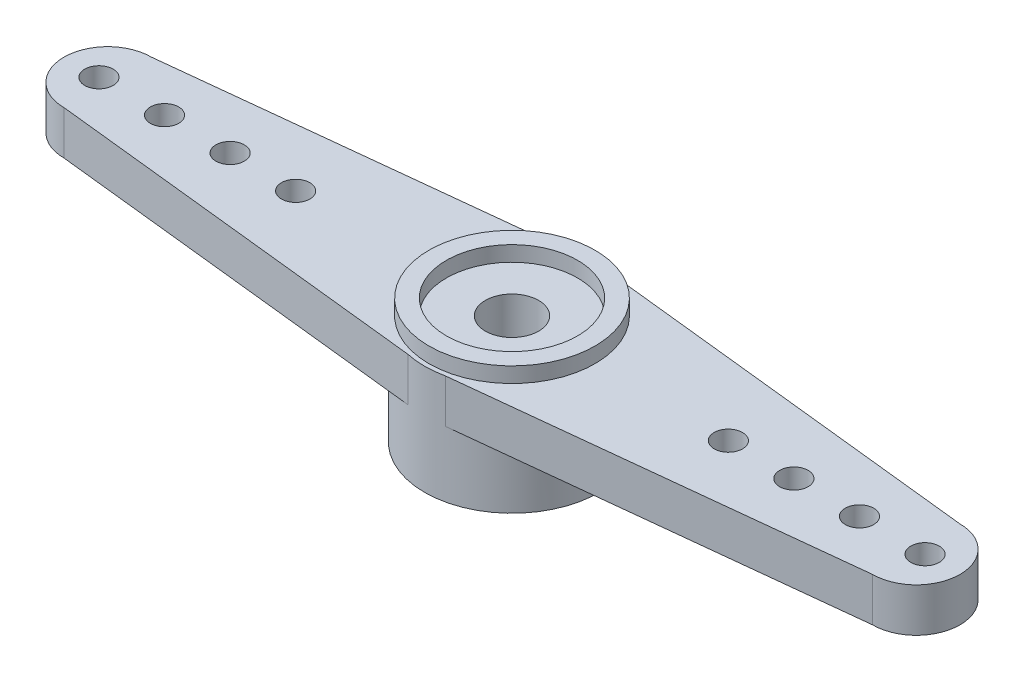
ISO-10303-21;
HEADER;
FILE_DESCRIPTION(('STEP AP214'),'2;1');
FILE_NAME('part.step','',(''),(''),'','','');
FILE_SCHEMA(('AUTOMOTIVE_DESIGN { 1 0 10303 214 1 1 1 1 }'));
ENDSEC;
DATA;
#1=APPLICATION_CONTEXT('core data for automotive mechanical design processes');
#2=APPLICATION_PROTOCOL_DEFINITION('international standard','automotive_design',2000,#1);
#3=PRODUCT_CONTEXT('',#1,'mechanical');
#4=PRODUCT('Part','Part','',(#3));
#5=PRODUCT_RELATED_PRODUCT_CATEGORY('part','',(#4));
#6=PRODUCT_DEFINITION_FORMATION('','',#4);
#7=PRODUCT_DEFINITION_CONTEXT('part definition',#1,'design');
#8=PRODUCT_DEFINITION('design','',#6,#7);
#9=PRODUCT_DEFINITION_SHAPE('','',#8);
#10=(LENGTH_UNIT() NAMED_UNIT(*) SI_UNIT(.MILLI.,.METRE.));
#11=(NAMED_UNIT(*) PLANE_ANGLE_UNIT() SI_UNIT($,.RADIAN.));
#12=(NAMED_UNIT(*) SI_UNIT($,.STERADIAN.) SOLID_ANGLE_UNIT());
#13=UNCERTAINTY_MEASURE_WITH_UNIT(LENGTH_MEASURE(1.E-05),#10,'distance_accuracy_value','');
#14=(GEOMETRIC_REPRESENTATION_CONTEXT(3) GLOBAL_UNCERTAINTY_ASSIGNED_CONTEXT((#13)) GLOBAL_UNIT_ASSIGNED_CONTEXT((#10,
#11,#12)) REPRESENTATION_CONTEXT('',''));
#15=CARTESIAN_POINT('',(0.,0.,0.));
#16=DIRECTION('',(0.,0.,1.));
#17=DIRECTION('',(1.,0.,0.));
#18=AXIS2_PLACEMENT_3D('',#15,#16,#17);
#19=CARTESIAN_POINT('',(0.,5.,0.));
#20=DIRECTION('',(0.,1.,0.));
#21=DIRECTION('',(0.,0.,1.));
#22=AXIS2_PLACEMENT_3D('',#19,#20,#21);
#23=PLANE('',#22);
#24=CARTESIAN_POINT('',(15.9,5.,0.));
#25=DIRECTION('',(0.,-1.,0.));
#26=DIRECTION('',(0.,0.,1.));
#27=AXIS2_PLACEMENT_3D('',#24,#25,#26);
#28=CIRCLE('',#27,0.649999999999999);
#29=CARTESIAN_POINT('',(15.9,5.,0.649999999999999));
#30=VERTEX_POINT('',#29);
#31=EDGE_CURVE('E247',#30,#30,#28,.T.);
#32=ORIENTED_EDGE('',*,*,#31,.T.);
#33=EDGE_LOOP('',(#32));
#34=FACE_BOUND('',#33,.T.);
#35=CARTESIAN_POINT('',(9.90000000000001,5.,0.));
#36=DIRECTION('',(0.,-1.,0.));
#37=DIRECTION('',(0.,0.,1.));
#38=AXIS2_PLACEMENT_3D('',#35,#36,#37);
#39=CIRCLE('',#38,0.649999999999999);
#40=CARTESIAN_POINT('',(9.90000000000001,5.,0.649999999999999));
#41=VERTEX_POINT('',#40);
#42=EDGE_CURVE('E263',#41,#41,#39,.T.);
#43=ORIENTED_EDGE('',*,*,#42,.T.);
#44=EDGE_LOOP('',(#43));
#45=FACE_BOUND('',#44,.T.);
#46=DIRECTION('',(0.994207047565849,0.,0.107481842980092));
#47=VECTOR('',#46,1.);
#48=CARTESIAN_POINT('',(-0.854873646209387,5.,3.90758122743682));
#49=LINE('',#48,#47);
#50=CARTESIAN_POINT('',(-18.5,5.,2.));
#51=VERTEX_POINT('',#50);
#52=CARTESIAN_POINT('',(-0.854873646209387,5.,3.90758122743682));
#53=VERTEX_POINT('',#52);
#54=EDGE_CURVE('E179',#51,#53,#49,.T.);
#55=ORIENTED_EDGE('',*,*,#54,.T.);
#56=CARTESIAN_POINT('',(0.,5.,0.));
#57=DIRECTION('',(0.,1.,0.));
#58=DIRECTION('',(0.,0.,1.));
#59=AXIS2_PLACEMENT_3D('',#56,#57,#58);
#60=CIRCLE('',#59,4.);
#61=CARTESIAN_POINT('',(0.854873646209387,5.,3.90758122743682));
#62=VERTEX_POINT('',#61);
#63=EDGE_CURVE('E117',#53,#62,#60,.T.);
#64=ORIENTED_EDGE('',*,*,#63,.T.);
#65=DIRECTION('',(-0.994207047565849,0.,0.107481842980092));
#66=VECTOR('',#65,1.);
#67=CARTESIAN_POINT('',(0.854873646209387,5.,3.90758122743682));
#68=LINE('',#67,#66);
#69=CARTESIAN_POINT('',(18.5,5.,2.));
#70=VERTEX_POINT('',#69);
#71=EDGE_CURVE('E99',#70,#62,#68,.T.);
#72=ORIENTED_EDGE('',*,*,#71,.F.);
#73=CARTESIAN_POINT('',(18.5,5.,0.));
#74=DIRECTION('',(0.,-1.,0.));
#75=DIRECTION('',(0.,0.,1.));
#76=AXIS2_PLACEMENT_3D('',#73,#74,#75);
#77=CIRCLE('',#76,2.);
#78=CARTESIAN_POINT('',(18.5,5.,-2.));
#79=VERTEX_POINT('',#78);
#80=EDGE_CURVE('E114',#79,#70,#77,.T.);
#81=ORIENTED_EDGE('',*,*,#80,.F.);
#82=DIRECTION('',(0.994207047565849,0.,0.107481842980092));
#83=VECTOR('',#82,1.);
#84=CARTESIAN_POINT('',(0.854873646209388,5.,-3.90758122743682));
#85=LINE('',#84,#83);
#86=CARTESIAN_POINT('',(0.854873646209388,5.,-3.90758122743682));
#87=VERTEX_POINT('',#86);
#88=EDGE_CURVE('E121',#87,#79,#85,.T.);
#89=ORIENTED_EDGE('',*,*,#88,.F.);
#90=CARTESIAN_POINT('',(-0.854873646209388,5.,-3.90758122743682));
#91=VERTEX_POINT('',#90);
#92=EDGE_CURVE('E53',#87,#91,#60,.T.);
#93=ORIENTED_EDGE('',*,*,#92,.T.);
#94=DIRECTION('',(-0.994207047565849,0.,0.107481842980092));
#95=VECTOR('',#94,1.);
#96=CARTESIAN_POINT('',(-0.854873646209388,5.,-3.90758122743682));
#97=LINE('',#96,#95);
#98=CARTESIAN_POINT('',(-18.5,5.,-2.));
#99=VERTEX_POINT('',#98);
#100=EDGE_CURVE('E175',#91,#99,#97,.T.);
#101=ORIENTED_EDGE('',*,*,#100,.T.);
#102=CARTESIAN_POINT('',(-18.5,5.,0.));
#103=DIRECTION('',(0.,1.,0.));
#104=DIRECTION('',(0.,0.,1.));
#105=AXIS2_PLACEMENT_3D('',#102,#103,#104);
#106=CIRCLE('',#105,2.);
#107=EDGE_CURVE('E177',#99,#51,#106,.T.);
#108=ORIENTED_EDGE('',*,*,#107,.T.);
#109=EDGE_LOOP('',(#55,#64,#72,#81,#89,#93,#101,#108));
#110=FACE_BOUND('',#109,.T.);
#111=CARTESIAN_POINT('',(-9.90000000000001,5.,0.));
#112=DIRECTION('',(0.,1.,0.));
#113=DIRECTION('',(0.,0.,1.));
#114=AXIS2_PLACEMENT_3D('',#111,#112,#113);
#115=CIRCLE('',#114,0.649999999999999);
#116=CARTESIAN_POINT('',(-9.90000000000001,5.,0.649999999999999));
#117=VERTEX_POINT('',#116);
#118=EDGE_CURVE('E165',#117,#117,#115,.T.);
#119=ORIENTED_EDGE('',*,*,#118,.F.);
#120=EDGE_LOOP('',(#119));
#121=FACE_BOUND('',#120,.T.);
#122=CARTESIAN_POINT('',(-12.9,5.,0.));
#123=DIRECTION('',(0.,1.,0.));
#124=DIRECTION('',(0.,0.,1.));
#125=AXIS2_PLACEMENT_3D('',#122,#123,#124);
#126=CIRCLE('',#125,0.649999999999999);
#127=CARTESIAN_POINT('',(-12.9,5.,0.649999999999999));
#128=VERTEX_POINT('',#127);
#129=EDGE_CURVE('E159',#128,#128,#126,.T.);
#130=ORIENTED_EDGE('',*,*,#129,.F.);
#131=EDGE_LOOP('',(#130));
#132=FACE_BOUND('',#131,.T.);
#133=CARTESIAN_POINT('',(-15.9,5.,0.));
#134=DIRECTION('',(0.,1.,0.));
#135=DIRECTION('',(0.,0.,1.));
#136=AXIS2_PLACEMENT_3D('',#133,#134,#135);
#137=CIRCLE('',#136,0.649999999999999);
#138=CARTESIAN_POINT('',(-15.9,5.,0.649999999999999));
#139=VERTEX_POINT('',#138);
#140=EDGE_CURVE('E153',#139,#139,#137,.T.);
#141=ORIENTED_EDGE('',*,*,#140,.F.);
#142=EDGE_LOOP('',(#141));
#143=FACE_BOUND('',#142,.T.);
#144=CARTESIAN_POINT('',(-18.9,5.,0.));
#145=DIRECTION('',(0.,1.,0.));
#146=DIRECTION('',(0.,0.,1.));
#147=AXIS2_PLACEMENT_3D('',#144,#145,#146);
#148=CIRCLE('',#147,0.650000000000001);
#149=CARTESIAN_POINT('',(-18.9,5.,0.650000000000001));
#150=VERTEX_POINT('',#149);
#151=EDGE_CURVE('E147',#150,#150,#148,.T.);
#152=ORIENTED_EDGE('',*,*,#151,.F.);
#153=EDGE_LOOP('',(#152));
#154=FACE_BOUND('',#153,.T.);
#155=CARTESIAN_POINT('',(0.,5.,0.));
#156=DIRECTION('',(0.,1.,0.));
#157=DIRECTION('',(0.,0.,1.));
#158=AXIS2_PLACEMENT_3D('',#155,#156,#157);
#159=CIRCLE('',#158,3.8);
#160=CARTESIAN_POINT('',(0.,5.,3.8));
#161=VERTEX_POINT('',#160);
#162=EDGE_CURVE('E143',#161,#161,#159,.T.);
#163=ORIENTED_EDGE('',*,*,#162,.F.);
#164=EDGE_LOOP('',(#163));
#165=FACE_BOUND('',#164,.T.);
#166=CARTESIAN_POINT('',(12.9,5.,0.));
#167=DIRECTION('',(0.,-1.,0.));
#168=DIRECTION('',(0.,0.,1.));
#169=AXIS2_PLACEMENT_3D('',#166,#167,#168);
#170=CIRCLE('',#169,0.649999999999999);
#171=CARTESIAN_POINT('',(12.9,5.,0.649999999999999));
#172=VERTEX_POINT('',#171);
#173=EDGE_CURVE('E260',#172,#172,#170,.T.);
#174=ORIENTED_EDGE('',*,*,#173,.T.);
#175=EDGE_LOOP('',(#174));
#176=FACE_BOUND('',#175,.T.);
#177=CARTESIAN_POINT('',(18.9,5.,0.));
#178=DIRECTION('',(0.,-1.,0.));
#179=DIRECTION('',(0.,0.,1.));
#180=AXIS2_PLACEMENT_3D('',#177,#178,#179);
#181=CIRCLE('',#180,0.650000000000001);
#182=CARTESIAN_POINT('',(18.9,5.,0.650000000000001));
#183=VERTEX_POINT('',#182);
#184=EDGE_CURVE('E248',#183,#183,#181,.T.);
#185=ORIENTED_EDGE('',*,*,#184,.T.);
#186=EDGE_LOOP('',(#185));
#187=FACE_BOUND('',#186,.T.);
#188=ADVANCED_FACE('F31',(#34,#45,#110,#121,#132,#143,#154,#165,#176,#187),#23,.T.);
#189=CARTESIAN_POINT('',(0.,3.,0.));
#190=DIRECTION('',(0.,1.,0.));
#191=DIRECTION('',(0.,0.,1.));
#192=AXIS2_PLACEMENT_3D('',#189,#190,#191);
#193=PLANE('',#192);
#194=CARTESIAN_POINT('',(15.9,3.,0.));
#195=DIRECTION('',(0.,-1.,0.));
#196=DIRECTION('',(0.,0.,1.));
#197=AXIS2_PLACEMENT_3D('',#194,#195,#196);
#198=CIRCLE('',#197,0.649999999999999);
#199=CARTESIAN_POINT('',(15.9,3.,0.649999999999999));
#200=VERTEX_POINT('',#199);
#201=EDGE_CURVE('E251',#200,#200,#198,.T.);
#202=ORIENTED_EDGE('',*,*,#201,.F.);
#203=EDGE_LOOP('',(#202));
#204=FACE_BOUND('',#203,.T.);
#205=CARTESIAN_POINT('',(9.90000000000001,3.,0.));
#206=DIRECTION('',(0.,-1.,0.));
#207=DIRECTION('',(0.,0.,1.));
#208=AXIS2_PLACEMENT_3D('',#205,#206,#207);
#209=CIRCLE('',#208,0.649999999999999);
#210=CARTESIAN_POINT('',(9.90000000000001,3.,0.649999999999999));
#211=VERTEX_POINT('',#210);
#212=EDGE_CURVE('E129',#211,#211,#209,.T.);
#213=ORIENTED_EDGE('',*,*,#212,.F.);
#214=EDGE_LOOP('',(#213));
#215=FACE_BOUND('',#214,.T.);
#216=DIRECTION('',(-0.994207047565849,0.,0.107481842980092));
#217=VECTOR('',#216,1.);
#218=CARTESIAN_POINT('',(0.854873646209387,3.,3.90758122743682));
#219=LINE('',#218,#217);
#220=CARTESIAN_POINT('',(18.5,3.,2.));
#221=VERTEX_POINT('',#220);
#222=CARTESIAN_POINT('',(0.854873646209387,3.,3.90758122743682));
#223=VERTEX_POINT('',#222);
#224=EDGE_CURVE('E101',#221,#223,#219,.T.);
#225=ORIENTED_EDGE('',*,*,#224,.T.);
#226=CARTESIAN_POINT('',(0.,3.,0.));
#227=DIRECTION('',(0.,1.,0.));
#228=DIRECTION('',(0.,0.,1.));
#229=AXIS2_PLACEMENT_3D('',#226,#227,#228);
#230=CIRCLE('',#229,4.);
#231=CARTESIAN_POINT('',(0.854873646209388,3.,-3.90758122743682));
#232=VERTEX_POINT('',#231);
#233=EDGE_CURVE('E47',#223,#232,#230,.T.);
#234=ORIENTED_EDGE('',*,*,#233,.T.);
#235=DIRECTION('',(0.994207047565849,0.,0.107481842980092));
#236=VECTOR('',#235,1.);
#237=CARTESIAN_POINT('',(0.854873646209388,3.,-3.90758122743682));
#238=LINE('',#237,#236);
#239=CARTESIAN_POINT('',(18.5,3.,-2.));
#240=VERTEX_POINT('',#239);
#241=EDGE_CURVE('E118',#232,#240,#238,.T.);
#242=ORIENTED_EDGE('',*,*,#241,.T.);
#243=CARTESIAN_POINT('',(18.5,3.,0.));
#244=DIRECTION('',(0.,-1.,0.));
#245=DIRECTION('',(0.,0.,1.));
#246=AXIS2_PLACEMENT_3D('',#243,#244,#245);
#247=CIRCLE('',#246,2.);
#248=EDGE_CURVE('E128',#240,#221,#247,.T.);
#249=ORIENTED_EDGE('',*,*,#248,.T.);
#250=EDGE_LOOP('',(#225,#234,#242,#249));
#251=FACE_BOUND('',#250,.T.);
#252=CARTESIAN_POINT('',(12.9,3.,0.));
#253=DIRECTION('',(0.,-1.,0.));
#254=DIRECTION('',(0.,0.,1.));
#255=AXIS2_PLACEMENT_3D('',#252,#253,#254);
#256=CIRCLE('',#255,0.649999999999999);
#257=CARTESIAN_POINT('',(12.9,3.,0.649999999999999));
#258=VERTEX_POINT('',#257);
#259=EDGE_CURVE('E242',#258,#258,#256,.T.);
#260=ORIENTED_EDGE('',*,*,#259,.F.);
#261=EDGE_LOOP('',(#260));
#262=FACE_BOUND('',#261,.T.);
#263=CARTESIAN_POINT('',(18.9,3.,0.));
#264=DIRECTION('',(0.,-1.,0.));
#265=DIRECTION('',(0.,0.,1.));
#266=AXIS2_PLACEMENT_3D('',#263,#264,#265);
#267=CIRCLE('',#266,0.650000000000001);
#268=CARTESIAN_POINT('',(18.9,3.,0.650000000000001));
#269=VERTEX_POINT('',#268);
#270=EDGE_CURVE('E245',#269,#269,#267,.T.);
#271=ORIENTED_EDGE('',*,*,#270,.F.);
#272=EDGE_LOOP('',(#271));
#273=FACE_BOUND('',#272,.T.);
#274=ADVANCED_FACE('F232',(#204,#215,#251,#262,#273),#193,.F.);
#275=CARTESIAN_POINT('',(0.,3.7,0.));
#276=DIRECTION('',(0.,-1.,0.));
#277=DIRECTION('',(0.,0.,-1.));
#278=AXIS2_PLACEMENT_3D('',#275,#276,#277);
#279=CYLINDRICAL_SURFACE('',#278,3.);
#280=CARTESIAN_POINT('',(0.,0.,0.));
#281=DIRECTION('',(0.,-1.,0.));
#282=DIRECTION('',(0.,0.,-1.));
#283=AXIS2_PLACEMENT_3D('',#280,#281,#282);
#284=CIRCLE('',#283,3.);
#285=CARTESIAN_POINT('',(0.,0.,-3.));
#286=VERTEX_POINT('',#285);
#287=EDGE_CURVE('E137',#286,#286,#284,.T.);
#288=ORIENTED_EDGE('',*,*,#287,.T.);
#289=EDGE_LOOP('',(#288));
#290=FACE_BOUND('',#289,.T.);
#291=CARTESIAN_POINT('',(0.,3.,0.));
#292=DIRECTION('',(0.,1.,0.));
#293=DIRECTION('',(0.,0.,1.));
#294=AXIS2_PLACEMENT_3D('',#291,#292,#293);
#295=CIRCLE('',#294,3.);
#296=CARTESIAN_POINT('',(0.,3.,3.));
#297=VERTEX_POINT('',#296);
#298=EDGE_CURVE('E11',#297,#297,#295,.F.);
#299=ORIENTED_EDGE('',*,*,#298,.F.);
#300=EDGE_LOOP('',(#299));
#301=FACE_BOUND('',#300,.T.);
#302=ADVANCED_FACE('F235',(#290,#301),#279,.F.);
#303=CARTESIAN_POINT('',(0.,3.,0.));
#304=DIRECTION('',(0.,-1.,0.));
#305=DIRECTION('',(0.,0.,-1.));
#306=AXIS2_PLACEMENT_3D('',#303,#304,#305);
#307=CYLINDRICAL_SURFACE('',#306,4.);
#308=DIRECTION('',(0.,-1.,0.));
#309=VECTOR('',#308,1.);
#310=CARTESIAN_POINT('',(0.854873646209388,5.,-3.90758122743682));
#311=LINE('',#310,#309);
#312=EDGE_CURVE('E123',#87,#232,#311,.T.);
#313=ORIENTED_EDGE('',*,*,#312,.T.);
#314=ORIENTED_EDGE('',*,*,#233,.F.);
#315=DIRECTION('',(0.,-1.,0.));
#316=VECTOR('',#315,1.);
#317=CARTESIAN_POINT('',(0.854873646209387,5.,3.90758122743682));
#318=LINE('',#317,#316);
#319=EDGE_CURVE('E106',#62,#223,#318,.T.);
#320=ORIENTED_EDGE('',*,*,#319,.F.);
#321=ORIENTED_EDGE('',*,*,#63,.F.);
#322=DIRECTION('',(0.,-1.,0.));
#323=VECTOR('',#322,1.);
#324=CARTESIAN_POINT('',(-0.854873646209387,5.,3.90758122743682));
#325=LINE('',#324,#323);
#326=CARTESIAN_POINT('',(-0.854873646209387,3.,3.90758122743682));
#327=VERTEX_POINT('',#326);
#328=EDGE_CURVE('E181',#53,#327,#325,.T.);
#329=ORIENTED_EDGE('',*,*,#328,.T.);
#330=CARTESIAN_POINT('',(0.,3.,0.));
#331=DIRECTION('',(0.,1.,0.));
#332=DIRECTION('',(0.,0.,1.));
#333=AXIS2_PLACEMENT_3D('',#330,#331,#332);
#334=CIRCLE('',#333,4.);
#335=CARTESIAN_POINT('',(-0.854873646209388,3.,-3.90758122743682));
#336=VERTEX_POINT('',#335);
#337=EDGE_CURVE('E40',#336,#327,#334,.T.);
#338=ORIENTED_EDGE('',*,*,#337,.F.);
#339=DIRECTION('',(0.,-1.,0.));
#340=VECTOR('',#339,1.);
#341=CARTESIAN_POINT('',(-0.854873646209388,5.,-3.90758122743682));
#342=LINE('',#341,#340);
#343=EDGE_CURVE('E191',#91,#336,#342,.T.);
#344=ORIENTED_EDGE('',*,*,#343,.F.);
#345=ORIENTED_EDGE('',*,*,#92,.F.);
#346=EDGE_LOOP('',(#313,#314,#320,#321,#329,#338,#344,#345));
#347=FACE_BOUND('',#346,.T.);
#348=CARTESIAN_POINT('',(0.,0.,0.));
#349=DIRECTION('',(0.,1.,0.));
#350=DIRECTION('',(0.,0.,1.));
#351=AXIS2_PLACEMENT_3D('',#348,#349,#350);
#352=CIRCLE('',#351,4.);
#353=CARTESIAN_POINT('',(0.,0.,4.));
#354=VERTEX_POINT('',#353);
#355=EDGE_CURVE('E192',#354,#354,#352,.T.);
#356=ORIENTED_EDGE('',*,*,#355,.T.);
#357=EDGE_LOOP('',(#356));
#358=FACE_BOUND('',#357,.T.);
#359=ADVANCED_FACE('F33',(#347,#358),#307,.T.);
#360=CARTESIAN_POINT('',(0.,0.,0.));
#361=DIRECTION('',(0.,1.,0.));
#362=DIRECTION('',(0.,0.,1.));
#363=AXIS2_PLACEMENT_3D('',#360,#361,#362);
#364=PLANE('',#363);
#365=ORIENTED_EDGE('',*,*,#287,.F.);
#366=EDGE_LOOP('',(#365));
#367=FACE_BOUND('',#366,.T.);
#368=ORIENTED_EDGE('',*,*,#355,.F.);
#369=EDGE_LOOP('',(#368));
#370=FACE_BOUND('',#369,.T.);
#371=ADVANCED_FACE('F398',(#367,#370),#364,.F.);
#372=CARTESIAN_POINT('',(0.,3.,0.));
#373=DIRECTION('',(0.,1.,0.));
#374=DIRECTION('',(0.,0.,1.));
#375=AXIS2_PLACEMENT_3D('',#372,#373,#374);
#376=PLANE('',#375);
#377=CARTESIAN_POINT('',(-18.9,3.,0.));
#378=DIRECTION('',(0.,1.,0.));
#379=DIRECTION('',(0.,0.,1.));
#380=AXIS2_PLACEMENT_3D('',#377,#378,#379);
#381=CIRCLE('',#380,0.650000000000001);
#382=CARTESIAN_POINT('',(-18.9,3.,0.650000000000001));
#383=VERTEX_POINT('',#382);
#384=EDGE_CURVE('E150',#383,#383,#381,.T.);
#385=ORIENTED_EDGE('',*,*,#384,.T.);
#386=EDGE_LOOP('',(#385));
#387=FACE_BOUND('',#386,.T.);
#388=CARTESIAN_POINT('',(-15.9,3.,0.));
#389=DIRECTION('',(0.,1.,0.));
#390=DIRECTION('',(0.,0.,1.));
#391=AXIS2_PLACEMENT_3D('',#388,#389,#390);
#392=CIRCLE('',#391,0.649999999999999);
#393=CARTESIAN_POINT('',(-15.9,3.,0.649999999999999));
#394=VERTEX_POINT('',#393);
#395=EDGE_CURVE('E156',#394,#394,#392,.T.);
#396=ORIENTED_EDGE('',*,*,#395,.T.);
#397=EDGE_LOOP('',(#396));
#398=FACE_BOUND('',#397,.T.);
#399=CARTESIAN_POINT('',(-12.9,3.,0.));
#400=DIRECTION('',(0.,1.,0.));
#401=DIRECTION('',(0.,0.,1.));
#402=AXIS2_PLACEMENT_3D('',#399,#400,#401);
#403=CIRCLE('',#402,0.649999999999999);
#404=CARTESIAN_POINT('',(-12.9,3.,0.649999999999999));
#405=VERTEX_POINT('',#404);
#406=EDGE_CURVE('E162',#405,#405,#403,.T.);
#407=ORIENTED_EDGE('',*,*,#406,.T.);
#408=EDGE_LOOP('',(#407));
#409=FACE_BOUND('',#408,.T.);
#410=CARTESIAN_POINT('',(-9.90000000000001,3.,0.));
#411=DIRECTION('',(0.,1.,0.));
#412=DIRECTION('',(0.,0.,1.));
#413=AXIS2_PLACEMENT_3D('',#410,#411,#412);
#414=CIRCLE('',#413,0.649999999999999);
#415=CARTESIAN_POINT('',(-9.90000000000001,3.,0.649999999999999));
#416=VERTEX_POINT('',#415);
#417=EDGE_CURVE('E168',#416,#416,#414,.T.);
#418=ORIENTED_EDGE('',*,*,#417,.T.);
#419=EDGE_LOOP('',(#418));
#420=FACE_BOUND('',#419,.T.);
#421=DIRECTION('',(-0.994207047565849,0.,0.107481842980092));
#422=VECTOR('',#421,1.);
#423=CARTESIAN_POINT('',(-0.854873646209388,3.,-3.90758122743682));
#424=LINE('',#423,#422);
#425=CARTESIAN_POINT('',(-18.5,3.,-2.));
#426=VERTEX_POINT('',#425);
#427=EDGE_CURVE('E171',#336,#426,#424,.T.);
#428=ORIENTED_EDGE('',*,*,#427,.F.);
#429=ORIENTED_EDGE('',*,*,#337,.T.);
#430=DIRECTION('',(0.994207047565849,0.,0.107481842980092));
#431=VECTOR('',#430,1.);
#432=CARTESIAN_POINT('',(-0.854873646209387,3.,3.90758122743682));
#433=LINE('',#432,#431);
#434=CARTESIAN_POINT('',(-18.5,3.,2.));
#435=VERTEX_POINT('',#434);
#436=EDGE_CURVE('E184',#435,#327,#433,.T.);
#437=ORIENTED_EDGE('',*,*,#436,.F.);
#438=CARTESIAN_POINT('',(-18.5,3.,0.));
#439=DIRECTION('',(0.,1.,0.));
#440=DIRECTION('',(0.,0.,1.));
#441=AXIS2_PLACEMENT_3D('',#438,#439,#440);
#442=CIRCLE('',#441,2.);
#443=EDGE_CURVE('E182',#426,#435,#442,.T.);
#444=ORIENTED_EDGE('',*,*,#443,.F.);
#445=EDGE_LOOP('',(#428,#429,#437,#444));
#446=FACE_BOUND('',#445,.T.);
#447=ADVANCED_FACE('F222',(#387,#398,#409,#420,#446),#376,.F.);
#448=CARTESIAN_POINT('',(-0.854873646209388,5.,-3.90758122743682));
#449=DIRECTION('',(0.107481842980092,0.,0.994207047565849));
#450=DIRECTION('',(0.994207047565849,0.,-0.107481842980092));
#451=AXIS2_PLACEMENT_3D('',#448,#449,#450);
#452=PLANE('',#451);
#453=ORIENTED_EDGE('',*,*,#427,.T.);
#454=DIRECTION('',(0.,-1.,0.));
#455=VECTOR('',#454,1.);
#456=CARTESIAN_POINT('',(-18.5,5.,-2.));
#457=LINE('',#456,#455);
#458=EDGE_CURVE('E188',#99,#426,#457,.T.);
#459=ORIENTED_EDGE('',*,*,#458,.F.);
#460=ORIENTED_EDGE('',*,*,#100,.F.);
#461=ORIENTED_EDGE('',*,*,#343,.T.);
#462=EDGE_LOOP('',(#453,#459,#460,#461));
#463=FACE_BOUND('',#462,.T.);
#464=ADVANCED_FACE('F226',(#463),#452,.F.);
#465=CARTESIAN_POINT('',(-18.5,5.,0.));
#466=DIRECTION('',(0.,-1.,0.));
#467=DIRECTION('',(0.,0.,-1.));
#468=AXIS2_PLACEMENT_3D('',#465,#466,#467);
#469=CYLINDRICAL_SURFACE('',#468,2.);
#470=ORIENTED_EDGE('',*,*,#443,.T.);
#471=DIRECTION('',(0.,-1.,0.));
#472=VECTOR('',#471,1.);
#473=CARTESIAN_POINT('',(-18.5,5.,2.));
#474=LINE('',#473,#472);
#475=EDGE_CURVE('E185',#51,#435,#474,.T.);
#476=ORIENTED_EDGE('',*,*,#475,.F.);
#477=ORIENTED_EDGE('',*,*,#107,.F.);
#478=ORIENTED_EDGE('',*,*,#458,.T.);
#479=EDGE_LOOP('',(#470,#476,#477,#478));
#480=FACE_BOUND('',#479,.T.);
#481=ADVANCED_FACE('F492',(#480),#469,.T.);
#482=CARTESIAN_POINT('',(-0.854873646209387,5.,3.90758122743682));
#483=DIRECTION('',(0.107481842980092,0.,-0.994207047565849));
#484=DIRECTION('',(-0.994207047565849,0.,-0.107481842980092));
#485=AXIS2_PLACEMENT_3D('',#482,#483,#484);
#486=PLANE('',#485);
#487=ORIENTED_EDGE('',*,*,#436,.T.);
#488=ORIENTED_EDGE('',*,*,#328,.F.);
#489=ORIENTED_EDGE('',*,*,#54,.F.);
#490=ORIENTED_EDGE('',*,*,#475,.T.);
#491=EDGE_LOOP('',(#487,#488,#489,#490));
#492=FACE_BOUND('',#491,.T.);
#493=ADVANCED_FACE('F217',(#492),#486,.F.);
#494=CARTESIAN_POINT('',(-9.90000000000001,3.,0.));
#495=DIRECTION('',(0.,1.,0.));
#496=DIRECTION('',(0.,0.,1.));
#497=AXIS2_PLACEMENT_3D('',#494,#495,#496);
#498=CYLINDRICAL_SURFACE('',#497,0.649999999999999);
#499=ORIENTED_EDGE('',*,*,#417,.F.);
#500=EDGE_LOOP('',(#499));
#501=FACE_BOUND('',#500,.T.);
#502=ORIENTED_EDGE('',*,*,#118,.T.);
#503=EDGE_LOOP('',(#502));
#504=FACE_BOUND('',#503,.T.);
#505=ADVANCED_FACE('F466',(#501,#504),#498,.F.);
#506=CARTESIAN_POINT('',(-12.9,3.,0.));
#507=DIRECTION('',(0.,1.,0.));
#508=DIRECTION('',(0.,0.,1.));
#509=AXIS2_PLACEMENT_3D('',#506,#507,#508);
#510=CYLINDRICAL_SURFACE('',#509,0.649999999999999);
#511=ORIENTED_EDGE('',*,*,#406,.F.);
#512=EDGE_LOOP('',(#511));
#513=FACE_BOUND('',#512,.T.);
#514=ORIENTED_EDGE('',*,*,#129,.T.);
#515=EDGE_LOOP('',(#514));
#516=FACE_BOUND('',#515,.T.);
#517=ADVANCED_FACE('F456',(#513,#516),#510,.F.);
#518=CARTESIAN_POINT('',(-15.9,3.,0.));
#519=DIRECTION('',(0.,1.,0.));
#520=DIRECTION('',(0.,0.,1.));
#521=AXIS2_PLACEMENT_3D('',#518,#519,#520);
#522=CYLINDRICAL_SURFACE('',#521,0.649999999999999);
#523=ORIENTED_EDGE('',*,*,#395,.F.);
#524=EDGE_LOOP('',(#523));
#525=FACE_BOUND('',#524,.T.);
#526=ORIENTED_EDGE('',*,*,#140,.T.);
#527=EDGE_LOOP('',(#526));
#528=FACE_BOUND('',#527,.T.);
#529=ADVANCED_FACE('F446',(#525,#528),#522,.F.);
#530=CARTESIAN_POINT('',(-18.9,3.,0.));
#531=DIRECTION('',(0.,1.,0.));
#532=DIRECTION('',(0.,0.,1.));
#533=AXIS2_PLACEMENT_3D('',#530,#531,#532);
#534=CYLINDRICAL_SURFACE('',#533,0.650000000000001);
#535=ORIENTED_EDGE('',*,*,#384,.F.);
#536=EDGE_LOOP('',(#535));
#537=FACE_BOUND('',#536,.T.);
#538=ORIENTED_EDGE('',*,*,#151,.T.);
#539=EDGE_LOOP('',(#538));
#540=FACE_BOUND('',#539,.T.);
#541=ADVANCED_FACE('F322',(#537,#540),#534,.F.);
#542=CARTESIAN_POINT('',(0.,5.7,0.));
#543=DIRECTION('',(0.,-1.,0.));
#544=DIRECTION('',(0.,0.,-1.));
#545=AXIS2_PLACEMENT_3D('',#542,#543,#544);
#546=CYLINDRICAL_SURFACE('',#545,3.8);
#547=CARTESIAN_POINT('',(0.,5.7,0.));
#548=DIRECTION('',(0.,1.,0.));
#549=DIRECTION('',(0.,0.,1.));
#550=AXIS2_PLACEMENT_3D('',#547,#548,#549);
#551=CIRCLE('',#550,3.8);
#552=CARTESIAN_POINT('',(0.,5.7,3.8));
#553=VERTEX_POINT('',#552);
#554=EDGE_CURVE('E144',#553,#553,#551,.T.);
#555=ORIENTED_EDGE('',*,*,#554,.F.);
#556=EDGE_LOOP('',(#555));
#557=FACE_BOUND('',#556,.T.);
#558=ORIENTED_EDGE('',*,*,#162,.T.);
#559=EDGE_LOOP('',(#558));
#560=FACE_BOUND('',#559,.T.);
#561=ADVANCED_FACE('F316',(#557,#560),#546,.T.);
#562=CARTESIAN_POINT('',(0.,5.7,0.));
#563=DIRECTION('',(0.,1.,0.));
#564=DIRECTION('',(0.,0.,1.));
#565=AXIS2_PLACEMENT_3D('',#562,#563,#564);
#566=PLANE('',#565);
#567=CARTESIAN_POINT('',(0.,5.7,0.));
#568=DIRECTION('',(0.,1.,0.));
#569=DIRECTION('',(0.,0.,1.));
#570=AXIS2_PLACEMENT_3D('',#567,#568,#569);
#571=CIRCLE('',#570,3.);
#572=CARTESIAN_POINT('',(0.,5.7,3.));
#573=VERTEX_POINT('',#572);
#574=EDGE_CURVE('E140',#573,#573,#571,.T.);
#575=ORIENTED_EDGE('',*,*,#574,.F.);
#576=EDGE_LOOP('',(#575));
#577=FACE_BOUND('',#576,.T.);
#578=ORIENTED_EDGE('',*,*,#554,.T.);
#579=EDGE_LOOP('',(#578));
#580=FACE_BOUND('',#579,.T.);
#581=ADVANCED_FACE('F310',(#577,#580),#566,.T.);
#582=CARTESIAN_POINT('',(0.,4.7,0.));
#583=DIRECTION('',(0.,1.,0.));
#584=DIRECTION('',(0.,0.,1.));
#585=AXIS2_PLACEMENT_3D('',#582,#583,#584);
#586=CYLINDRICAL_SURFACE('',#585,3.);
#587=CARTESIAN_POINT('',(0.,5.,0.));
#588=DIRECTION('',(0.,1.,0.));
#589=DIRECTION('',(0.,0.,1.));
#590=AXIS2_PLACEMENT_3D('',#587,#588,#589);
#591=CIRCLE('',#590,3.);
#592=CARTESIAN_POINT('',(0.,5.,3.));
#593=VERTEX_POINT('',#592);
#594=EDGE_CURVE('E35',#593,#593,#591,.F.);
#595=ORIENTED_EDGE('',*,*,#594,.T.);
#596=EDGE_LOOP('',(#595));
#597=FACE_BOUND('',#596,.T.);
#598=ORIENTED_EDGE('',*,*,#574,.T.);
#599=EDGE_LOOP('',(#598));
#600=FACE_BOUND('',#599,.T.);
#601=ADVANCED_FACE('F299',(#597,#600),#586,.F.);
#602=CARTESIAN_POINT('',(0.,3.,0.));
#603=DIRECTION('',(0.,1.,0.));
#604=DIRECTION('',(0.,0.,1.));
#605=AXIS2_PLACEMENT_3D('',#602,#603,#604);
#606=CIRCLE('',#605,1.21967570261157);
#607=CARTESIAN_POINT('',(0.,3.,1.21967570261157));
#608=VERTEX_POINT('',#607);
#609=EDGE_CURVE('E254',#608,#608,#606,.T.);
#610=ORIENTED_EDGE('',*,*,#609,.T.);
#611=EDGE_LOOP('',(#610));
#612=FACE_BOUND('',#611,.T.);
#613=ORIENTED_EDGE('',*,*,#298,.T.);
#614=EDGE_LOOP('',(#613));
#615=FACE_BOUND('',#614,.T.);
#616=ADVANCED_FACE('F238',(#612,#615),#193,.F.);
#617=CARTESIAN_POINT('',(0.,5.,0.));
#618=DIRECTION('',(0.,1.,0.));
#619=DIRECTION('',(0.,0.,1.));
#620=AXIS2_PLACEMENT_3D('',#617,#618,#619);
#621=CIRCLE('',#620,1.21967570261157);
#622=CARTESIAN_POINT('',(0.,5.,1.21967570261157));
#623=VERTEX_POINT('',#622);
#624=EDGE_CURVE('E304',#623,#623,#621,.T.);
#625=ORIENTED_EDGE('',*,*,#624,.F.);
#626=EDGE_LOOP('',(#625));
#627=FACE_BOUND('',#626,.T.);
#628=ORIENTED_EDGE('',*,*,#594,.F.);
#629=EDGE_LOOP('',(#628));
#630=FACE_BOUND('',#629,.T.);
#631=ADVANCED_FACE('F287',(#627,#630),#23,.T.);
#632=CARTESIAN_POINT('',(0.854873646209387,5.,3.90758122743682));
#633=DIRECTION('',(0.107481842980092,0.,0.994207047565849));
#634=DIRECTION('',(0.994207047565849,0.,-0.107481842980092));
#635=AXIS2_PLACEMENT_3D('',#632,#633,#634);
#636=PLANE('',#635);
#637=ORIENTED_EDGE('',*,*,#224,.F.);
#638=DIRECTION('',(0.,-1.,0.));
#639=VECTOR('',#638,1.);
#640=CARTESIAN_POINT('',(18.5,5.,2.));
#641=LINE('',#640,#639);
#642=EDGE_CURVE('E96',#70,#221,#641,.T.);
#643=ORIENTED_EDGE('',*,*,#642,.F.);
#644=ORIENTED_EDGE('',*,*,#71,.T.);
#645=ORIENTED_EDGE('',*,*,#319,.T.);
#646=EDGE_LOOP('',(#637,#643,#644,#645));
#647=FACE_BOUND('',#646,.T.);
#648=ADVANCED_FACE('F98',(#647),#636,.T.);
#649=CARTESIAN_POINT('',(18.5,5.,0.));
#650=DIRECTION('',(0.,-1.,0.));
#651=DIRECTION('',(0.,0.,-1.));
#652=AXIS2_PLACEMENT_3D('',#649,#650,#651);
#653=CYLINDRICAL_SURFACE('',#652,2.);
#654=ORIENTED_EDGE('',*,*,#248,.F.);
#655=DIRECTION('',(0.,-1.,0.));
#656=VECTOR('',#655,1.);
#657=CARTESIAN_POINT('',(18.5,5.,-2.));
#658=LINE('',#657,#656);
#659=EDGE_CURVE('E107',#79,#240,#658,.T.);
#660=ORIENTED_EDGE('',*,*,#659,.F.);
#661=ORIENTED_EDGE('',*,*,#80,.T.);
#662=ORIENTED_EDGE('',*,*,#642,.T.);
#663=EDGE_LOOP('',(#654,#660,#661,#662));
#664=FACE_BOUND('',#663,.T.);
#665=ADVANCED_FACE('F120',(#664),#653,.T.);
#666=CARTESIAN_POINT('',(0.854873646209388,5.,-3.90758122743682));
#667=DIRECTION('',(0.107481842980092,0.,-0.994207047565849));
#668=DIRECTION('',(-0.994207047565849,0.,-0.107481842980092));
#669=AXIS2_PLACEMENT_3D('',#666,#667,#668);
#670=PLANE('',#669);
#671=ORIENTED_EDGE('',*,*,#241,.F.);
#672=ORIENTED_EDGE('',*,*,#312,.F.);
#673=ORIENTED_EDGE('',*,*,#88,.T.);
#674=ORIENTED_EDGE('',*,*,#659,.T.);
#675=EDGE_LOOP('',(#671,#672,#673,#674));
#676=FACE_BOUND('',#675,.T.);
#677=ADVANCED_FACE('F230',(#676),#670,.T.);
#678=CARTESIAN_POINT('',(9.90000000000001,3.,0.));
#679=DIRECTION('',(0.,1.,0.));
#680=DIRECTION('',(0.,0.,1.));
#681=AXIS2_PLACEMENT_3D('',#678,#679,#680);
#682=CYLINDRICAL_SURFACE('',#681,0.649999999999999);
#683=ORIENTED_EDGE('',*,*,#212,.T.);
#684=EDGE_LOOP('',(#683));
#685=FACE_BOUND('',#684,.T.);
#686=ORIENTED_EDGE('',*,*,#42,.F.);
#687=EDGE_LOOP('',(#686));
#688=FACE_BOUND('',#687,.T.);
#689=ADVANCED_FACE('F271',(#685,#688),#682,.F.);
#690=CARTESIAN_POINT('',(12.9,3.,0.));
#691=DIRECTION('',(0.,1.,0.));
#692=DIRECTION('',(0.,0.,1.));
#693=AXIS2_PLACEMENT_3D('',#690,#691,#692);
#694=CYLINDRICAL_SURFACE('',#693,0.649999999999999);
#695=ORIENTED_EDGE('',*,*,#259,.T.);
#696=EDGE_LOOP('',(#695));
#697=FACE_BOUND('',#696,.T.);
#698=ORIENTED_EDGE('',*,*,#173,.F.);
#699=EDGE_LOOP('',(#698));
#700=FACE_BOUND('',#699,.T.);
#701=ADVANCED_FACE('F273',(#697,#700),#694,.F.);
#702=CARTESIAN_POINT('',(15.9,3.,0.));
#703=DIRECTION('',(0.,1.,0.));
#704=DIRECTION('',(0.,0.,1.));
#705=AXIS2_PLACEMENT_3D('',#702,#703,#704);
#706=CYLINDRICAL_SURFACE('',#705,0.649999999999999);
#707=ORIENTED_EDGE('',*,*,#201,.T.);
#708=EDGE_LOOP('',(#707));
#709=FACE_BOUND('',#708,.T.);
#710=ORIENTED_EDGE('',*,*,#31,.F.);
#711=EDGE_LOOP('',(#710));
#712=FACE_BOUND('',#711,.T.);
#713=ADVANCED_FACE('F280',(#709,#712),#706,.F.);
#714=CARTESIAN_POINT('',(18.9,3.,0.));
#715=DIRECTION('',(0.,1.,0.));
#716=DIRECTION('',(0.,0.,1.));
#717=AXIS2_PLACEMENT_3D('',#714,#715,#716);
#718=CYLINDRICAL_SURFACE('',#717,0.650000000000001);
#719=ORIENTED_EDGE('',*,*,#270,.T.);
#720=EDGE_LOOP('',(#719));
#721=FACE_BOUND('',#720,.T.);
#722=ORIENTED_EDGE('',*,*,#184,.F.);
#723=EDGE_LOOP('',(#722));
#724=FACE_BOUND('',#723,.T.);
#725=ADVANCED_FACE('F331',(#721,#724),#718,.F.);
#726=CARTESIAN_POINT('',(0.,-35.,0.));
#727=DIRECTION('',(0.,1.,0.));
#728=DIRECTION('',(0.,0.,1.));
#729=AXIS2_PLACEMENT_3D('',#726,#727,#728);
#730=CYLINDRICAL_SURFACE('',#729,1.21967570261157);
#731=ORIENTED_EDGE('',*,*,#624,.T.);
#732=EDGE_LOOP('',(#731));
#733=FACE_BOUND('',#732,.T.);
#734=ORIENTED_EDGE('',*,*,#609,.F.);
#735=EDGE_LOOP('',(#734));
#736=FACE_BOUND('',#735,.T.);
#737=ADVANCED_FACE('F333',(#733,#736),#730,.F.);
#738=CLOSED_SHELL('',(#188,#274,#302,#359,#371,#447,#464,#481,#493,#505,#517,#529,#541,#561,
#581,#601,#616,#631,#648,#665,#677,#689,#701,#713,#725,#737));
#739=MANIFOLD_SOLID_BREP('B2',#738);
#740=ADVANCED_BREP_SHAPE_REPRESENTATION('',(#18,#739),#14);
#741=SHAPE_DEFINITION_REPRESENTATION(#9,#740);
ENDSEC;
END-ISO-10303-21;
